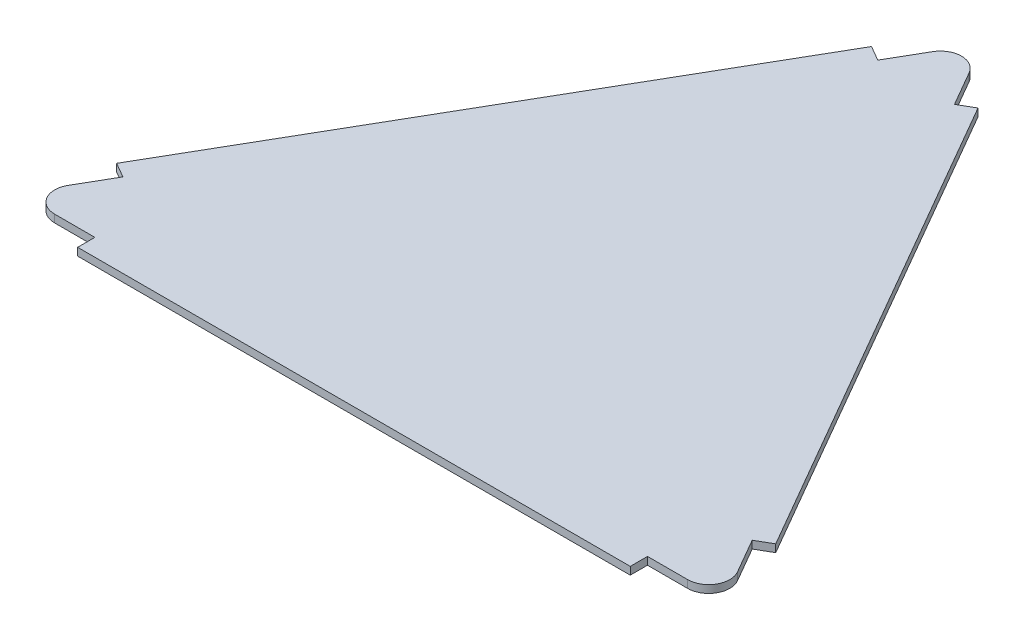
ISO-10303-21;
HEADER;
FILE_DESCRIPTION(('STEP AP214'),'2;1');
FILE_NAME('part.step','',(''),(''),'','','');
FILE_SCHEMA(('AUTOMOTIVE_DESIGN { 1 0 10303 214 1 1 1 1 }'));
ENDSEC;
DATA;
#1=APPLICATION_CONTEXT('core data for automotive mechanical design processes');
#2=APPLICATION_PROTOCOL_DEFINITION('international standard','automotive_design',2000,#1);
#3=PRODUCT_CONTEXT('',#1,'mechanical');
#4=PRODUCT('Part','Part','',(#3));
#5=PRODUCT_RELATED_PRODUCT_CATEGORY('part','',(#4));
#6=PRODUCT_DEFINITION_FORMATION('','',#4);
#7=PRODUCT_DEFINITION_CONTEXT('part definition',#1,'design');
#8=PRODUCT_DEFINITION('design','',#6,#7);
#9=PRODUCT_DEFINITION_SHAPE('','',#8);
#10=(LENGTH_UNIT() NAMED_UNIT(*) SI_UNIT(.MILLI.,.METRE.));
#11=(NAMED_UNIT(*) PLANE_ANGLE_UNIT() SI_UNIT($,.RADIAN.));
#12=(NAMED_UNIT(*) SI_UNIT($,.STERADIAN.) SOLID_ANGLE_UNIT());
#13=UNCERTAINTY_MEASURE_WITH_UNIT(LENGTH_MEASURE(1.E-05),#10,'distance_accuracy_value','');
#14=(GEOMETRIC_REPRESENTATION_CONTEXT(3) GLOBAL_UNCERTAINTY_ASSIGNED_CONTEXT((#13)) GLOBAL_UNIT_ASSIGNED_CONTEXT((#10,
#11,#12)) REPRESENTATION_CONTEXT('',''));
#15=CARTESIAN_POINT('',(0.,0.,0.));
#16=DIRECTION('',(0.,0.,1.));
#17=DIRECTION('',(1.,0.,0.));
#18=AXIS2_PLACEMENT_3D('',#15,#16,#17);
#19=CARTESIAN_POINT('',(0.,0.,0.));
#20=DIRECTION('',(0.,1.,0.));
#21=DIRECTION('',(0.,0.,1.));
#22=AXIS2_PLACEMENT_3D('',#19,#20,#21);
#23=PLANE('',#22);
#24=DIRECTION('',(-1.,0.,0.));
#25=VECTOR('',#24,1.);
#26=CARTESIAN_POINT('',(3.42795965091437E-13,0.,53.2350269189623));
#27=LINE('',#26,#25);
#28=CARTESIAN_POINT('',(-72.1794919243108,0.,53.2350269189628));
#29=VERTEX_POINT('',#28);
#30=CARTESIAN_POINT('',(-82.6794919243108,0.,53.2350269189629));
#31=VERTEX_POINT('',#30);
#32=EDGE_CURVE('E371',#29,#31,#27,.T.);
#33=ORIENTED_EDGE('',*,*,#32,.T.);
#34=CARTESIAN_POINT('',(-82.6794919243108,0.,47.7350269189628));
#35=DIRECTION('',(0.,1.,0.));
#36=DIRECTION('',(0.,0.,1.));
#37=AXIS2_PLACEMENT_3D('',#34,#35,#36);
#38=CIRCLE('',#37,5.50000000000001);
#39=CARTESIAN_POINT('',(-87.4426316451252,0.,44.9850269189627));
#40=VERTEX_POINT('',#39);
#41=EDGE_CURVE('E390',#31,#40,#38,.F.);
#42=ORIENTED_EDGE('',*,*,#41,.T.);
#43=DIRECTION('',(0.499999999999996,0.,-0.866025403784441));
#44=VECTOR('',#43,1.);
#45=CARTESIAN_POINT('',(-46.1028856829701,0.,-26.617513459481));
#46=LINE('',#45,#44);
#47=CARTESIAN_POINT('',(-82.1926316451252,0.,35.8917601792261));
#48=VERTEX_POINT('',#47);
#49=EDGE_CURVE('E417',#40,#48,#46,.T.);
#50=ORIENTED_EDGE('',*,*,#49,.T.);
#51=DIRECTION('',(-0.866025403784439,0.,-0.499999999999999));
#52=VECTOR('',#51,1.);
#53=CARTESIAN_POINT('',(-36.0897459621554,0.,62.5092736387071));
#54=LINE('',#53,#52);
#55=CARTESIAN_POINT('',(-86.0897459621552,0.,33.6417601792261));
#56=VERTEX_POINT('',#55);
#57=EDGE_CURVE('E421',#48,#56,#54,.T.);
#58=ORIENTED_EDGE('',*,*,#57,.T.);
#59=DIRECTION('',(-0.499999999999998,0.,0.86602540378444));
#60=VECTOR('',#59,1.);
#61=CARTESIAN_POINT('',(-49.9999999999998,0.,-28.867513459481));
#62=LINE('',#61,#60);
#63=CARTESIAN_POINT('',(-13.9102540378444,0.,-91.3767870981883));
#64=VERTEX_POINT('',#63);
#65=EDGE_CURVE('E446',#64,#56,#62,.T.);
#66=ORIENTED_EDGE('',*,*,#65,.F.);
#67=DIRECTION('',(0.866025403784439,0.,0.499999999999999));
#68=VECTOR('',#67,1.);
#69=CARTESIAN_POINT('',(36.0897459621555,0.,-62.5092736387072));
#70=LINE('',#69,#68);
#71=CARTESIAN_POINT('',(-10.0131397208144,0.,-89.1267870981883));
#72=VERTEX_POINT('',#71);
#73=EDGE_CURVE('E425',#64,#72,#70,.T.);
#74=ORIENTED_EDGE('',*,*,#73,.T.);
#75=DIRECTION('',(0.499999999999998,0.,-0.86602540378444));
#76=VECTOR('',#75,1.);
#77=CARTESIAN_POINT('',(-46.1028856829698,0.,-26.6175134594811));
#78=LINE('',#77,#76);
#79=CARTESIAN_POINT('',(-4.76313972081441,0.,-98.2200538379249));
#80=VERTEX_POINT('',#79);
#81=EDGE_CURVE('E429',#72,#80,#78,.T.);
#82=ORIENTED_EDGE('',*,*,#81,.T.);
#83=CARTESIAN_POINT('',(0.,0.,-95.470053837925));
#84=DIRECTION('',(0.,1.,0.));
#85=DIRECTION('',(0.,0.,1.));
#86=AXIS2_PLACEMENT_3D('',#83,#84,#85);
#87=CIRCLE('',#86,5.5);
#88=CARTESIAN_POINT('',(4.76313972081314,0.,-98.2200538379249));
#89=VERTEX_POINT('',#88);
#90=EDGE_CURVE('E433',#80,#89,#87,.F.);
#91=ORIENTED_EDGE('',*,*,#90,.T.);
#92=DIRECTION('',(0.500000000000012,0.,0.866025403784432));
#93=VECTOR('',#92,1.);
#94=CARTESIAN_POINT('',(46.1028856829696,0.,-26.6175134594819));
#95=LINE('',#94,#93);
#96=CARTESIAN_POINT('',(10.0131397208133,0.,-89.1267870981883));
#97=VERTEX_POINT('',#96);
#98=EDGE_CURVE('E341',#89,#97,#95,.T.);
#99=ORIENTED_EDGE('',*,*,#98,.T.);
#100=DIRECTION('',(0.866025403784433,0.,-0.500000000000009));
#101=VECTOR('',#100,1.);
#102=CARTESIAN_POINT('',(-36.0897459621562,0.,-62.5092736387067));
#103=LINE('',#102,#101);
#104=CARTESIAN_POINT('',(13.9102540378432,0.,-91.3767870981883));
#105=VERTEX_POINT('',#104);
#106=EDGE_CURVE('E345',#97,#105,#103,.T.);
#107=ORIENTED_EDGE('',*,*,#106,.T.);
#108=DIRECTION('',(-0.500000000000002,0.,-0.866025403784437));
#109=VECTOR('',#108,1.);
#110=CARTESIAN_POINT('',(50.0000000000001,0.,-28.8675134594815));
#111=LINE('',#110,#109);
#112=CARTESIAN_POINT('',(86.0897459621557,0.,33.6417601792251));
#113=VERTEX_POINT('',#112);
#114=EDGE_CURVE('E436',#113,#105,#111,.T.);
#115=ORIENTED_EDGE('',*,*,#114,.F.);
#116=DIRECTION('',(-0.866025403784433,0.,0.500000000000009));
#117=VECTOR('',#116,1.);
#118=CARTESIAN_POINT('',(36.0897459621562,0.,62.5092736387067));
#119=LINE('',#118,#117);
#120=CARTESIAN_POINT('',(82.1926316451258,0.,35.8917601792251));
#121=VERTEX_POINT('',#120);
#122=EDGE_CURVE('E350',#113,#121,#119,.T.);
#123=ORIENTED_EDGE('',*,*,#122,.T.);
#124=DIRECTION('',(0.50000000000001,0.,0.866025403784433));
#125=VECTOR('',#124,1.);
#126=CARTESIAN_POINT('',(46.1028856829695,0.,-26.6175134594817));
#127=LINE('',#126,#125);
#128=CARTESIAN_POINT('',(87.4426316451258,0.,44.9850269189617));
#129=VERTEX_POINT('',#128);
#130=EDGE_CURVE('E354',#121,#129,#127,.T.);
#131=ORIENTED_EDGE('',*,*,#130,.T.);
#132=CARTESIAN_POINT('',(82.6794919243115,0.,47.7350269189617));
#133=DIRECTION('',(0.,1.,0.));
#134=DIRECTION('',(0.,0.,1.));
#135=AXIS2_PLACEMENT_3D('',#132,#133,#134);
#136=CIRCLE('',#135,5.50000000000001);
#137=CARTESIAN_POINT('',(82.6794919243114,0.,53.2350269189617));
#138=VERTEX_POINT('',#137);
#139=EDGE_CURVE('E358',#129,#138,#136,.F.);
#140=ORIENTED_EDGE('',*,*,#139,.T.);
#141=DIRECTION('',(-1.,0.,0.));
#142=VECTOR('',#141,1.);
#143=CARTESIAN_POINT('',(5.02373397116763E-13,0.,53.2350269189625));
#144=LINE('',#143,#142);
#145=CARTESIAN_POINT('',(72.1794919243114,0.,53.2350269189618));
#146=VERTEX_POINT('',#145);
#147=EDGE_CURVE('E362',#138,#146,#144,.T.);
#148=ORIENTED_EDGE('',*,*,#147,.T.);
#149=DIRECTION('',(0.,0.,1.));
#150=VECTOR('',#149,1.);
#151=CARTESIAN_POINT('',(72.179491924311,0.,-4.28724036044619E-13));
#152=LINE('',#151,#150);
#153=CARTESIAN_POINT('',(72.1794919243114,0.,57.7350269189618));
#154=VERTEX_POINT('',#153);
#155=EDGE_CURVE('E366',#146,#154,#152,.T.);
#156=ORIENTED_EDGE('',*,*,#155,.T.);
#157=DIRECTION('',(1.,0.,0.));
#158=VECTOR('',#157,1.);
#159=CARTESIAN_POINT('',(3.99747511782896E-13,0.,57.7350269189623));
#160=LINE('',#159,#158);
#161=CARTESIAN_POINT('',(-72.1794919243108,0.,57.7350269189628));
#162=VERTEX_POINT('',#161);
#163=EDGE_CURVE('E157',#162,#154,#160,.T.);
#164=ORIENTED_EDGE('',*,*,#163,.F.);
#165=DIRECTION('',(0.,0.,-1.));
#166=VECTOR('',#165,1.);
#167=CARTESIAN_POINT('',(-72.1794919243111,0.,4.00676669200579E-13));
#168=LINE('',#167,#166);
#169=EDGE_CURVE('E290',#162,#29,#168,.T.);
#170=ORIENTED_EDGE('',*,*,#169,.T.);
#171=EDGE_LOOP('',(#33,#42,#50,#58,#66,#74,#82,#91,#99,#107,#115,#123,#131,#140,#148,#156,#164,#170));
#172=FACE_BOUND('',#171,.T.);
#173=ADVANCED_FACE('F153',(#172),#23,.F.);
#174=CARTESIAN_POINT('',(-49.9999999999998,2.,-28.867513459481));
#175=DIRECTION('',(0.86602540378444,0.,0.499999999999998));
#176=DIRECTION('',(0.499999999999998,0.,-0.86602540378444));
#177=AXIS2_PLACEMENT_3D('',#174,#175,#176);
#178=PLANE('',#177);
#179=DIRECTION('',(-0.499999999999998,0.,0.86602540378444));
#180=VECTOR('',#179,1.);
#181=CARTESIAN_POINT('',(-49.9999999999998,2.,-28.867513459481));
#182=LINE('',#181,#180);
#183=CARTESIAN_POINT('',(-13.9102540378444,2.,-91.3767870981883));
#184=VERTEX_POINT('',#183);
#185=CARTESIAN_POINT('',(-86.0897459621552,2.,33.6417601792261));
#186=VERTEX_POINT('',#185);
#187=EDGE_CURVE('E163',#184,#186,#182,.T.);
#188=ORIENTED_EDGE('',*,*,#187,.F.);
#189=DIRECTION('',(0.,1.,0.));
#190=VECTOR('',#189,1.);
#191=CARTESIAN_POINT('',(-13.9102540378444,-3.,-91.3767870981883));
#192=LINE('',#191,#190);
#193=EDGE_CURVE('E179',#64,#184,#192,.T.);
#194=ORIENTED_EDGE('',*,*,#193,.F.);
#195=ORIENTED_EDGE('',*,*,#65,.T.);
#196=DIRECTION('',(0.,1.,0.));
#197=VECTOR('',#196,1.);
#198=CARTESIAN_POINT('',(-86.0897459621552,-3.,33.6417601792261));
#199=LINE('',#198,#197);
#200=EDGE_CURVE('E375',#56,#186,#199,.T.);
#201=ORIENTED_EDGE('',*,*,#200,.T.);
#202=EDGE_LOOP('',(#188,#194,#195,#201));
#203=FACE_BOUND('',#202,.T.);
#204=ADVANCED_FACE('F453',(#203),#178,.F.);
#205=CARTESIAN_POINT('',(3.99747511782896E-13,2.,57.7350269189623));
#206=DIRECTION('',(0.,0.,-1.));
#207=DIRECTION('',(-1.,0.,0.));
#208=AXIS2_PLACEMENT_3D('',#205,#206,#207);
#209=PLANE('',#208);
#210=DIRECTION('',(1.,0.,0.));
#211=VECTOR('',#210,1.);
#212=CARTESIAN_POINT('',(3.99747511782896E-13,2.,57.7350269189623));
#213=LINE('',#212,#211);
#214=CARTESIAN_POINT('',(-72.1794919243108,2.,57.7350269189628));
#215=VERTEX_POINT('',#214);
#216=CARTESIAN_POINT('',(72.1794919243114,2.,57.7350269189618));
#217=VERTEX_POINT('',#216);
#218=EDGE_CURVE('E12',#215,#217,#213,.T.);
#219=ORIENTED_EDGE('',*,*,#218,.F.);
#220=DIRECTION('',(0.,1.,0.));
#221=VECTOR('',#220,1.);
#222=CARTESIAN_POINT('',(-72.1794919243108,-3.,57.7350269189628));
#223=LINE('',#222,#221);
#224=EDGE_CURVE('E283',#162,#215,#223,.T.);
#225=ORIENTED_EDGE('',*,*,#224,.F.);
#226=ORIENTED_EDGE('',*,*,#163,.T.);
#227=DIRECTION('',(0.,1.,0.));
#228=VECTOR('',#227,1.);
#229=CARTESIAN_POINT('',(72.1794919243114,-3.,57.7350269189618));
#230=LINE('',#229,#228);
#231=EDGE_CURVE('E304',#154,#217,#230,.T.);
#232=ORIENTED_EDGE('',*,*,#231,.T.);
#233=EDGE_LOOP('',(#219,#225,#226,#232));
#234=FACE_BOUND('',#233,.T.);
#235=ADVANCED_FACE('F307',(#234),#209,.F.);
#236=CARTESIAN_POINT('',(50.0000000000001,2.,-28.8675134594815));
#237=DIRECTION('',(-0.866025403784437,0.,0.500000000000003));
#238=DIRECTION('',(0.500000000000003,0.,0.866025403784437));
#239=AXIS2_PLACEMENT_3D('',#236,#237,#238);
#240=PLANE('',#239);
#241=DIRECTION('',(-0.500000000000002,0.,-0.866025403784437));
#242=VECTOR('',#241,1.);
#243=CARTESIAN_POINT('',(50.0000000000001,2.,-28.8675134594815));
#244=LINE('',#243,#242);
#245=CARTESIAN_POINT('',(86.0897459621556,2.,33.6417601792251));
#246=VERTEX_POINT('',#245);
#247=CARTESIAN_POINT('',(13.9102540378432,2.,-91.3767870981883));
#248=VERTEX_POINT('',#247);
#249=EDGE_CURVE('E437',#246,#248,#244,.T.);
#250=ORIENTED_EDGE('',*,*,#249,.F.);
#251=DIRECTION('',(0.,1.,0.));
#252=VECTOR('',#251,1.);
#253=CARTESIAN_POINT('',(86.0897459621557,-3.,33.6417601792251));
#254=LINE('',#253,#252);
#255=EDGE_CURVE('E171',#113,#246,#254,.T.);
#256=ORIENTED_EDGE('',*,*,#255,.F.);
#257=ORIENTED_EDGE('',*,*,#114,.T.);
#258=DIRECTION('',(0.,1.,0.));
#259=VECTOR('',#258,1.);
#260=CARTESIAN_POINT('',(13.9102540378432,-3.,-91.3767870981883));
#261=LINE('',#260,#259);
#262=EDGE_CURVE('E330',#105,#248,#261,.T.);
#263=ORIENTED_EDGE('',*,*,#262,.T.);
#264=EDGE_LOOP('',(#250,#256,#257,#263));
#265=FACE_BOUND('',#264,.T.);
#266=ADVANCED_FACE('F155',(#265),#240,.F.);
#267=CARTESIAN_POINT('',(0.,2.,0.));
#268=DIRECTION('',(0.,1.,0.));
#269=DIRECTION('',(0.,0.,1.));
#270=AXIS2_PLACEMENT_3D('',#267,#268,#269);
#271=PLANE('',#270);
#272=CARTESIAN_POINT('',(-82.6794919243108,2.,47.7350269189628));
#273=DIRECTION('',(0.,-1.,0.));
#274=DIRECTION('',(0.,0.,1.));
#275=AXIS2_PLACEMENT_3D('',#272,#273,#274);
#276=CIRCLE('',#275,5.50000000000001);
#277=CARTESIAN_POINT('',(-82.6794919243108,2.,53.2350269189629));
#278=VERTEX_POINT('',#277);
#279=CARTESIAN_POINT('',(-87.4426316451252,2.,44.9850269189627));
#280=VERTEX_POINT('',#279);
#281=EDGE_CURVE('E380',#278,#280,#276,.T.);
#282=ORIENTED_EDGE('',*,*,#281,.F.);
#283=DIRECTION('',(-1.,0.,0.));
#284=VECTOR('',#283,1.);
#285=CARTESIAN_POINT('',(-72.1794919243108,2.,53.2350269189628));
#286=LINE('',#285,#284);
#287=CARTESIAN_POINT('',(-72.1794919243108,2.,53.2350269189628));
#288=VERTEX_POINT('',#287);
#289=EDGE_CURVE('E297',#288,#278,#286,.T.);
#290=ORIENTED_EDGE('',*,*,#289,.F.);
#291=DIRECTION('',(0.,0.,-1.));
#292=VECTOR('',#291,1.);
#293=CARTESIAN_POINT('',(-72.1794919243108,2.,57.7350269189628));
#294=LINE('',#293,#292);
#295=EDGE_CURVE('E287',#215,#288,#294,.T.);
#296=ORIENTED_EDGE('',*,*,#295,.F.);
#297=ORIENTED_EDGE('',*,*,#218,.T.);
#298=DIRECTION('',(0.,0.,1.));
#299=VECTOR('',#298,1.);
#300=CARTESIAN_POINT('',(72.1794919243114,2.,57.7350269189618));
#301=LINE('',#300,#299);
#302=CARTESIAN_POINT('',(72.1794919243114,2.,53.2350269189618));
#303=VERTEX_POINT('',#302);
#304=EDGE_CURVE('E317',#303,#217,#301,.T.);
#305=ORIENTED_EDGE('',*,*,#304,.F.);
#306=DIRECTION('',(-1.,0.,0.));
#307=VECTOR('',#306,1.);
#308=CARTESIAN_POINT('',(72.1794919243114,2.,53.2350269189618));
#309=LINE('',#308,#307);
#310=CARTESIAN_POINT('',(82.6794919243114,2.,53.2350269189617));
#311=VERTEX_POINT('',#310);
#312=EDGE_CURVE('E504',#311,#303,#309,.T.);
#313=ORIENTED_EDGE('',*,*,#312,.F.);
#314=CARTESIAN_POINT('',(82.6794919243115,2.,47.7350269189617));
#315=DIRECTION('',(0.,-1.,0.));
#316=DIRECTION('',(0.866025403784436,0.,-0.500000000000004));
#317=AXIS2_PLACEMENT_3D('',#314,#315,#316);
#318=CIRCLE('',#317,5.50000000000001);
#319=CARTESIAN_POINT('',(87.4426316451258,2.,44.9850269189617));
#320=VERTEX_POINT('',#319);
#321=EDGE_CURVE('E496',#320,#311,#318,.T.);
#322=ORIENTED_EDGE('',*,*,#321,.F.);
#323=DIRECTION('',(0.50000000000001,0.,0.866025403784433));
#324=VECTOR('',#323,1.);
#325=CARTESIAN_POINT('',(82.1926316451258,2.,35.8917601792251));
#326=LINE('',#325,#324);
#327=CARTESIAN_POINT('',(82.1926316451258,2.,35.8917601792251));
#328=VERTEX_POINT('',#327);
#329=EDGE_CURVE('E498',#328,#320,#326,.T.);
#330=ORIENTED_EDGE('',*,*,#329,.F.);
#331=DIRECTION('',(-0.866025403784433,0.,0.500000000000009));
#332=VECTOR('',#331,1.);
#333=CARTESIAN_POINT('',(86.0897459621557,2.,33.6417601792251));
#334=LINE('',#333,#332);
#335=EDGE_CURVE('E334',#246,#328,#334,.T.);
#336=ORIENTED_EDGE('',*,*,#335,.F.);
#337=ORIENTED_EDGE('',*,*,#249,.T.);
#338=DIRECTION('',(0.866025403784433,0.,-0.500000000000009));
#339=VECTOR('',#338,1.);
#340=CARTESIAN_POINT('',(13.9102540378432,2.,-91.3767870981883));
#341=LINE('',#340,#339);
#342=CARTESIAN_POINT('',(10.0131397208133,2.,-89.1267870981883));
#343=VERTEX_POINT('',#342);
#344=EDGE_CURVE('E326',#343,#248,#341,.T.);
#345=ORIENTED_EDGE('',*,*,#344,.F.);
#346=DIRECTION('',(0.500000000000012,0.,0.866025403784431));
#347=VECTOR('',#346,1.);
#348=CARTESIAN_POINT('',(10.0131397208133,2.,-89.1267870981883));
#349=LINE('',#348,#347);
#350=CARTESIAN_POINT('',(4.76313972081314,2.,-98.2200538379249));
#351=VERTEX_POINT('',#350);
#352=EDGE_CURVE('E322',#351,#343,#349,.T.);
#353=ORIENTED_EDGE('',*,*,#352,.F.);
#354=CARTESIAN_POINT('',(0.,2.,-95.470053837925));
#355=DIRECTION('',(0.,-1.,0.));
#356=DIRECTION('',(0.,0.,1.));
#357=AXIS2_PLACEMENT_3D('',#354,#355,#356);
#358=CIRCLE('',#357,5.5);
#359=CARTESIAN_POINT('',(-4.76313972081441,2.,-98.2200538379249));
#360=VERTEX_POINT('',#359);
#361=EDGE_CURVE('E384',#360,#351,#358,.T.);
#362=ORIENTED_EDGE('',*,*,#361,.F.);
#363=DIRECTION('',(0.499999999999998,0.,-0.86602540378444));
#364=VECTOR('',#363,1.);
#365=CARTESIAN_POINT('',(-10.0131397208144,2.,-89.1267870981883));
#366=LINE('',#365,#364);
#367=CARTESIAN_POINT('',(-10.0131397208144,2.,-89.1267870981883));
#368=VERTEX_POINT('',#367);
#369=EDGE_CURVE('E379',#368,#360,#366,.T.);
#370=ORIENTED_EDGE('',*,*,#369,.F.);
#371=DIRECTION('',(0.866025403784439,0.,0.499999999999999));
#372=VECTOR('',#371,1.);
#373=CARTESIAN_POINT('',(-13.9102540378444,2.,-91.3767870981883));
#374=LINE('',#373,#372);
#375=EDGE_CURVE('E376',#184,#368,#374,.T.);
#376=ORIENTED_EDGE('',*,*,#375,.F.);
#377=ORIENTED_EDGE('',*,*,#187,.T.);
#378=DIRECTION('',(-0.866025403784439,0.,-0.499999999999999));
#379=VECTOR('',#378,1.);
#380=CARTESIAN_POINT('',(-86.0897459621552,2.,33.6417601792261));
#381=LINE('',#380,#379);
#382=CARTESIAN_POINT('',(-82.1926316451252,2.,35.8917601792261));
#383=VERTEX_POINT('',#382);
#384=EDGE_CURVE('E400',#383,#186,#381,.T.);
#385=ORIENTED_EDGE('',*,*,#384,.F.);
#386=DIRECTION('',(0.499999999999996,0.,-0.866025403784441));
#387=VECTOR('',#386,1.);
#388=CARTESIAN_POINT('',(-82.1926316451252,2.,35.8917601792261));
#389=LINE('',#388,#387);
#390=EDGE_CURVE('E409',#280,#383,#389,.T.);
#391=ORIENTED_EDGE('',*,*,#390,.F.);
#392=EDGE_LOOP('',(#282,#290,#296,#297,#305,#313,#322,#330,#336,#337,#345,#353,#362,#370,#376,
#377,#385,#391));
#393=FACE_BOUND('',#392,.T.);
#394=ADVANCED_FACE('F300',(#393),#271,.T.);
#395=CARTESIAN_POINT('',(-86.0897459621552,-3.,33.6417601792261));
#396=DIRECTION('',(0.499999999999999,0.,-0.866025403784439));
#397=DIRECTION('',(-0.866025403784439,0.,-0.499999999999999));
#398=AXIS2_PLACEMENT_3D('',#395,#396,#397);
#399=PLANE('',#398);
#400=DIRECTION('',(0.,1.,0.));
#401=VECTOR('',#400,1.);
#402=CARTESIAN_POINT('',(-82.1926316451252,-3.,35.8917601792261));
#403=LINE('',#402,#401);
#404=EDGE_CURVE('E401',#48,#383,#403,.T.);
#405=ORIENTED_EDGE('',*,*,#404,.T.);
#406=ORIENTED_EDGE('',*,*,#384,.T.);
#407=ORIENTED_EDGE('',*,*,#200,.F.);
#408=ORIENTED_EDGE('',*,*,#57,.F.);
#409=EDGE_LOOP('',(#405,#406,#407,#408));
#410=FACE_BOUND('',#409,.T.);
#411=ADVANCED_FACE('F458',(#410),#399,.F.);
#412=CARTESIAN_POINT('',(-82.1926316451252,-3.,35.8917601792261));
#413=DIRECTION('',(0.866025403784441,0.,0.499999999999996));
#414=DIRECTION('',(0.499999999999996,0.,-0.866025403784441));
#415=AXIS2_PLACEMENT_3D('',#412,#413,#414);
#416=PLANE('',#415);
#417=DIRECTION('',(0.,1.,0.));
#418=VECTOR('',#417,1.);
#419=CARTESIAN_POINT('',(-87.4426316451252,-3.,44.9850269189627));
#420=LINE('',#419,#418);
#421=EDGE_CURVE('E396',#40,#280,#420,.T.);
#422=ORIENTED_EDGE('',*,*,#421,.T.);
#423=ORIENTED_EDGE('',*,*,#390,.T.);
#424=ORIENTED_EDGE('',*,*,#404,.F.);
#425=ORIENTED_EDGE('',*,*,#49,.F.);
#426=EDGE_LOOP('',(#422,#423,#424,#425));
#427=FACE_BOUND('',#426,.T.);
#428=ADVANCED_FACE('F460',(#427),#416,.F.);
#429=CARTESIAN_POINT('',(-82.6794919243108,-3.,47.7350269189628));
#430=DIRECTION('',(0.,1.,0.));
#431=DIRECTION('',(0.,0.,1.));
#432=AXIS2_PLACEMENT_3D('',#429,#430,#431);
#433=CYLINDRICAL_SURFACE('',#432,5.50000000000001);
#434=ORIENTED_EDGE('',*,*,#421,.F.);
#435=ORIENTED_EDGE('',*,*,#41,.F.);
#436=DIRECTION('',(0.,1.,0.));
#437=VECTOR('',#436,1.);
#438=CARTESIAN_POINT('',(-82.6794919243108,-3.,53.2350269189629));
#439=LINE('',#438,#437);
#440=EDGE_CURVE('E346',#31,#278,#439,.T.);
#441=ORIENTED_EDGE('',*,*,#440,.T.);
#442=ORIENTED_EDGE('',*,*,#281,.T.);
#443=EDGE_LOOP('',(#434,#435,#441,#442));
#444=FACE_BOUND('',#443,.T.);
#445=ADVANCED_FACE('F574',(#444),#433,.T.);
#446=CARTESIAN_POINT('',(0.,-3.,-95.470053837925));
#447=DIRECTION('',(0.,1.,0.));
#448=DIRECTION('',(0.,0.,1.));
#449=AXIS2_PLACEMENT_3D('',#446,#447,#448);
#450=CYLINDRICAL_SURFACE('',#449,5.5);
#451=ORIENTED_EDGE('',*,*,#361,.T.);
#452=DIRECTION('',(0.,1.,0.));
#453=VECTOR('',#452,1.);
#454=CARTESIAN_POINT('',(4.76313972081314,-3.,-98.2200538379249));
#455=LINE('',#454,#453);
#456=EDGE_CURVE('E329',#89,#351,#455,.T.);
#457=ORIENTED_EDGE('',*,*,#456,.F.);
#458=ORIENTED_EDGE('',*,*,#90,.F.);
#459=DIRECTION('',(0.,1.,0.));
#460=VECTOR('',#459,1.);
#461=CARTESIAN_POINT('',(-4.76313972081441,-3.,-98.2200538379249));
#462=LINE('',#461,#460);
#463=EDGE_CURVE('E387',#80,#360,#462,.T.);
#464=ORIENTED_EDGE('',*,*,#463,.T.);
#465=EDGE_LOOP('',(#451,#457,#458,#464));
#466=FACE_BOUND('',#465,.T.);
#467=ADVANCED_FACE('F478',(#466),#450,.T.);
#468=CARTESIAN_POINT('',(-10.0131397208144,-3.,-89.1267870981883));
#469=DIRECTION('',(0.86602540378444,0.,0.499999999999998));
#470=DIRECTION('',(0.499999999999998,0.,-0.86602540378444));
#471=AXIS2_PLACEMENT_3D('',#468,#469,#470);
#472=PLANE('',#471);
#473=DIRECTION('',(0.,1.,0.));
#474=VECTOR('',#473,1.);
#475=CARTESIAN_POINT('',(-10.0131397208144,-3.,-89.1267870981883));
#476=LINE('',#475,#474);
#477=EDGE_CURVE('E391',#72,#368,#476,.T.);
#478=ORIENTED_EDGE('',*,*,#477,.T.);
#479=ORIENTED_EDGE('',*,*,#369,.T.);
#480=ORIENTED_EDGE('',*,*,#463,.F.);
#481=ORIENTED_EDGE('',*,*,#81,.F.);
#482=EDGE_LOOP('',(#478,#479,#480,#481));
#483=FACE_BOUND('',#482,.T.);
#484=ADVANCED_FACE('F469',(#483),#472,.F.);
#485=CARTESIAN_POINT('',(-13.9102540378444,-3.,-91.3767870981883));
#486=DIRECTION('',(-0.499999999999999,0.,0.866025403784439));
#487=DIRECTION('',(0.866025403784439,0.,0.499999999999999));
#488=AXIS2_PLACEMENT_3D('',#485,#486,#487);
#489=PLANE('',#488);
#490=ORIENTED_EDGE('',*,*,#193,.T.);
#491=ORIENTED_EDGE('',*,*,#375,.T.);
#492=ORIENTED_EDGE('',*,*,#477,.F.);
#493=ORIENTED_EDGE('',*,*,#73,.F.);
#494=EDGE_LOOP('',(#490,#491,#492,#493));
#495=FACE_BOUND('',#494,.T.);
#496=ADVANCED_FACE('F467',(#495),#489,.F.);
#497=CARTESIAN_POINT('',(13.9102540378432,-3.,-91.3767870981883));
#498=DIRECTION('',(0.500000000000009,0.,0.866025403784433));
#499=DIRECTION('',(0.866025403784433,0.,-0.500000000000009));
#500=AXIS2_PLACEMENT_3D('',#497,#498,#499);
#501=PLANE('',#500);
#502=DIRECTION('',(0.,1.,0.));
#503=VECTOR('',#502,1.);
#504=CARTESIAN_POINT('',(10.0131397208133,-3.,-89.1267870981883));
#505=LINE('',#504,#503);
#506=EDGE_CURVE('E335',#97,#343,#505,.T.);
#507=ORIENTED_EDGE('',*,*,#506,.T.);
#508=ORIENTED_EDGE('',*,*,#344,.T.);
#509=ORIENTED_EDGE('',*,*,#262,.F.);
#510=ORIENTED_EDGE('',*,*,#106,.F.);
#511=EDGE_LOOP('',(#507,#508,#509,#510));
#512=FACE_BOUND('',#511,.T.);
#513=ADVANCED_FACE('F482',(#512),#501,.F.);
#514=CARTESIAN_POINT('',(10.0131397208133,-3.,-89.1267870981883));
#515=DIRECTION('',(-0.866025403784431,0.,0.500000000000012));
#516=DIRECTION('',(0.500000000000012,0.,0.866025403784432));
#517=AXIS2_PLACEMENT_3D('',#514,#515,#516);
#518=PLANE('',#517);
#519=ORIENTED_EDGE('',*,*,#456,.T.);
#520=ORIENTED_EDGE('',*,*,#352,.T.);
#521=ORIENTED_EDGE('',*,*,#506,.F.);
#522=ORIENTED_EDGE('',*,*,#98,.F.);
#523=EDGE_LOOP('',(#519,#520,#521,#522));
#524=FACE_BOUND('',#523,.T.);
#525=ADVANCED_FACE('F476',(#524),#518,.F.);
#526=CARTESIAN_POINT('',(-72.1794919243108,-3.,53.2350269189628));
#527=DIRECTION('',(0.,0.,-1.));
#528=DIRECTION('',(-1.,0.,0.));
#529=AXIS2_PLACEMENT_3D('',#526,#527,#528);
#530=PLANE('',#529);
#531=DIRECTION('',(0.,1.,0.));
#532=VECTOR('',#531,1.);
#533=CARTESIAN_POINT('',(-72.1794919243108,-3.,53.2350269189628));
#534=LINE('',#533,#532);
#535=EDGE_CURVE('E296',#29,#288,#534,.T.);
#536=ORIENTED_EDGE('',*,*,#535,.T.);
#537=ORIENTED_EDGE('',*,*,#289,.T.);
#538=ORIENTED_EDGE('',*,*,#440,.F.);
#539=ORIENTED_EDGE('',*,*,#32,.F.);
#540=EDGE_LOOP('',(#536,#537,#538,#539));
#541=FACE_BOUND('',#540,.T.);
#542=ADVANCED_FACE('F530',(#541),#530,.F.);
#543=CARTESIAN_POINT('',(-72.1794919243108,-3.,57.7350269189628));
#544=DIRECTION('',(1.,0.,0.));
#545=DIRECTION('',(0.,0.,-1.));
#546=AXIS2_PLACEMENT_3D('',#543,#544,#545);
#547=PLANE('',#546);
#548=ORIENTED_EDGE('',*,*,#224,.T.);
#549=ORIENTED_EDGE('',*,*,#295,.T.);
#550=ORIENTED_EDGE('',*,*,#535,.F.);
#551=ORIENTED_EDGE('',*,*,#169,.F.);
#552=EDGE_LOOP('',(#548,#549,#550,#551));
#553=FACE_BOUND('',#552,.T.);
#554=ADVANCED_FACE('F285',(#553),#547,.F.);
#555=CARTESIAN_POINT('',(72.1794919243114,-3.,57.7350269189618));
#556=DIRECTION('',(-1.,0.,0.));
#557=DIRECTION('',(0.,0.,1.));
#558=AXIS2_PLACEMENT_3D('',#555,#556,#557);
#559=PLANE('',#558);
#560=DIRECTION('',(0.,1.,0.));
#561=VECTOR('',#560,1.);
#562=CARTESIAN_POINT('',(72.1794919243114,-3.,53.2350269189618));
#563=LINE('',#562,#561);
#564=EDGE_CURVE('E311',#146,#303,#563,.T.);
#565=ORIENTED_EDGE('',*,*,#564,.T.);
#566=ORIENTED_EDGE('',*,*,#304,.T.);
#567=ORIENTED_EDGE('',*,*,#231,.F.);
#568=ORIENTED_EDGE('',*,*,#155,.F.);
#569=EDGE_LOOP('',(#565,#566,#567,#568));
#570=FACE_BOUND('',#569,.T.);
#571=ADVANCED_FACE('F511',(#570),#559,.F.);
#572=CARTESIAN_POINT('',(72.1794919243114,-3.,53.2350269189618));
#573=DIRECTION('',(0.,0.,-1.));
#574=DIRECTION('',(-1.,0.,0.));
#575=AXIS2_PLACEMENT_3D('',#572,#573,#574);
#576=PLANE('',#575);
#577=DIRECTION('',(0.,1.,0.));
#578=VECTOR('',#577,1.);
#579=CARTESIAN_POINT('',(82.6794919243114,-3.,53.2350269189617));
#580=LINE('',#579,#578);
#581=EDGE_CURVE('E314',#138,#311,#580,.T.);
#582=ORIENTED_EDGE('',*,*,#581,.T.);
#583=ORIENTED_EDGE('',*,*,#312,.T.);
#584=ORIENTED_EDGE('',*,*,#564,.F.);
#585=ORIENTED_EDGE('',*,*,#147,.F.);
#586=EDGE_LOOP('',(#582,#583,#584,#585));
#587=FACE_BOUND('',#586,.T.);
#588=ADVANCED_FACE('F531',(#587),#576,.F.);
#589=CARTESIAN_POINT('',(82.6794919243115,-3.,47.7350269189617));
#590=DIRECTION('',(0.,1.,0.));
#591=DIRECTION('',(0.,0.,1.));
#592=AXIS2_PLACEMENT_3D('',#589,#590,#591);
#593=CYLINDRICAL_SURFACE('',#592,5.50000000000001);
#594=DIRECTION('',(0.,1.,0.));
#595=VECTOR('',#594,1.);
#596=CARTESIAN_POINT('',(87.4426316451258,-3.,44.9850269189617));
#597=LINE('',#596,#595);
#598=EDGE_CURVE('E492',#129,#320,#597,.T.);
#599=ORIENTED_EDGE('',*,*,#598,.T.);
#600=ORIENTED_EDGE('',*,*,#321,.T.);
#601=ORIENTED_EDGE('',*,*,#581,.F.);
#602=ORIENTED_EDGE('',*,*,#139,.F.);
#603=EDGE_LOOP('',(#599,#600,#601,#602));
#604=FACE_BOUND('',#603,.T.);
#605=ADVANCED_FACE('F515',(#604),#593,.T.);
#606=CARTESIAN_POINT('',(82.1926316451258,-3.,35.8917601792251));
#607=DIRECTION('',(-0.866025403784433,0.,0.50000000000001));
#608=DIRECTION('',(0.50000000000001,0.,0.866025403784433));
#609=AXIS2_PLACEMENT_3D('',#606,#607,#608);
#610=PLANE('',#609);
#611=DIRECTION('',(0.,1.,0.));
#612=VECTOR('',#611,1.);
#613=CARTESIAN_POINT('',(82.1926316451258,-3.,35.8917601792251));
#614=LINE('',#613,#612);
#615=EDGE_CURVE('E487',#121,#328,#614,.T.);
#616=ORIENTED_EDGE('',*,*,#615,.T.);
#617=ORIENTED_EDGE('',*,*,#329,.T.);
#618=ORIENTED_EDGE('',*,*,#598,.F.);
#619=ORIENTED_EDGE('',*,*,#130,.F.);
#620=EDGE_LOOP('',(#616,#617,#618,#619));
#621=FACE_BOUND('',#620,.T.);
#622=ADVANCED_FACE('F517',(#621),#610,.F.);
#623=CARTESIAN_POINT('',(86.0897459621557,-3.,33.6417601792251));
#624=DIRECTION('',(-0.500000000000009,0.,-0.866025403784433));
#625=DIRECTION('',(-0.866025403784433,0.,0.500000000000009));
#626=AXIS2_PLACEMENT_3D('',#623,#624,#625);
#627=PLANE('',#626);
#628=ORIENTED_EDGE('',*,*,#255,.T.);
#629=ORIENTED_EDGE('',*,*,#335,.T.);
#630=ORIENTED_EDGE('',*,*,#615,.F.);
#631=ORIENTED_EDGE('',*,*,#122,.F.);
#632=EDGE_LOOP('',(#628,#629,#630,#631));
#633=FACE_BOUND('',#632,.T.);
#634=ADVANCED_FACE('F486',(#633),#627,.F.);
#635=CLOSED_SHELL('',(#173,#204,#235,#266,#394,#411,#428,#445,#467,#484,#496,#513,#525,#542,
#554,#571,#588,#605,#622,#634));
#636=MANIFOLD_SOLID_BREP('B2',#635);
#637=ADVANCED_BREP_SHAPE_REPRESENTATION('',(#18,#636),#14);
#638=SHAPE_DEFINITION_REPRESENTATION(#9,#637);
ENDSEC;
END-ISO-10303-21;
